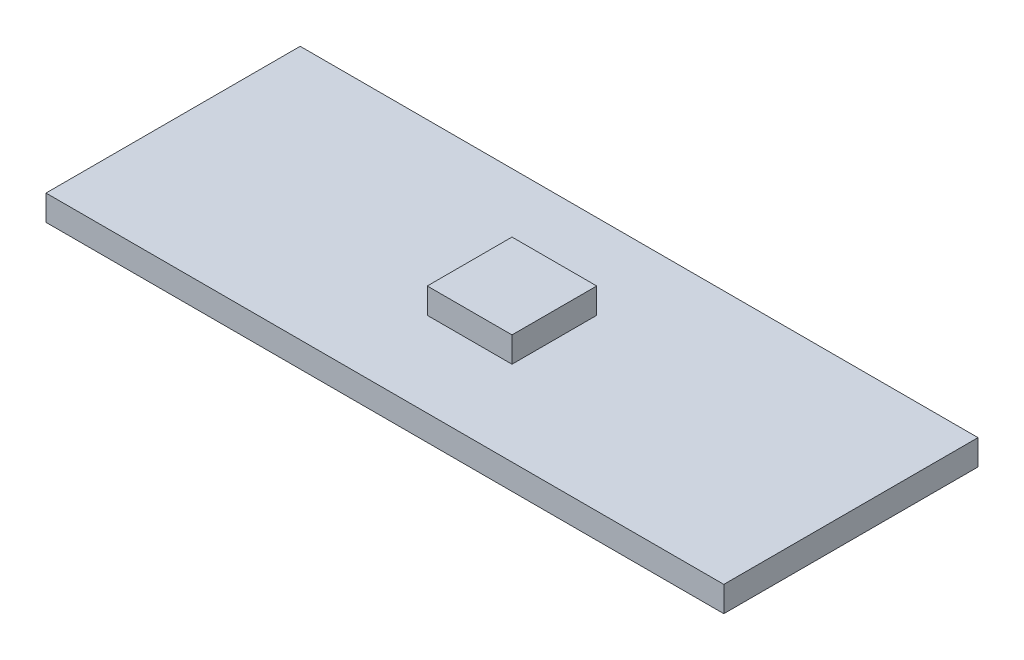
ISO-10303-21;
HEADER;
FILE_DESCRIPTION(('STEP AP214'),'2;1');
FILE_NAME('part.step','',(''),(''),'','','');
FILE_SCHEMA(('AUTOMOTIVE_DESIGN { 1 0 10303 214 1 1 1 1 }'));
ENDSEC;
DATA;
#1=APPLICATION_CONTEXT('core data for automotive mechanical design processes');
#2=APPLICATION_PROTOCOL_DEFINITION('international standard','automotive_design',2000,#1);
#3=PRODUCT_CONTEXT('',#1,'mechanical');
#4=PRODUCT('Part','Part','',(#3));
#5=PRODUCT_RELATED_PRODUCT_CATEGORY('part','',(#4));
#6=PRODUCT_DEFINITION_FORMATION('','',#4);
#7=PRODUCT_DEFINITION_CONTEXT('part definition',#1,'design');
#8=PRODUCT_DEFINITION('design','',#6,#7);
#9=PRODUCT_DEFINITION_SHAPE('','',#8);
#10=(LENGTH_UNIT() NAMED_UNIT(*) SI_UNIT(.MILLI.,.METRE.));
#11=(NAMED_UNIT(*) PLANE_ANGLE_UNIT() SI_UNIT($,.RADIAN.));
#12=(NAMED_UNIT(*) SI_UNIT($,.STERADIAN.) SOLID_ANGLE_UNIT());
#13=UNCERTAINTY_MEASURE_WITH_UNIT(LENGTH_MEASURE(1.E-05),#10,'distance_accuracy_value','');
#14=(GEOMETRIC_REPRESENTATION_CONTEXT(3) GLOBAL_UNCERTAINTY_ASSIGNED_CONTEXT((#13)) GLOBAL_UNIT_ASSIGNED_CONTEXT((#10,
#11,#12)) REPRESENTATION_CONTEXT('',''));
#15=CARTESIAN_POINT('',(0.,0.,0.));
#16=DIRECTION('',(0.,0.,1.));
#17=DIRECTION('',(1.,0.,0.));
#18=AXIS2_PLACEMENT_3D('',#15,#16,#17);
#19=CARTESIAN_POINT('',(0.,1.5,0.));
#20=DIRECTION('',(0.,-1.,0.));
#21=DIRECTION('',(0.,0.,-1.));
#22=AXIS2_PLACEMENT_3D('',#19,#20,#21);
#23=PLANE('',#22);
#24=DIRECTION('',(0.,0.,-1.));
#25=VECTOR('',#24,1.);
#26=CARTESIAN_POINT('',(20.,1.5,7.5));
#27=LINE('',#26,#25);
#28=CARTESIAN_POINT('',(20.,1.5,7.5));
#29=VERTEX_POINT('',#28);
#30=CARTESIAN_POINT('',(20.,1.5,-7.5));
#31=VERTEX_POINT('',#30);
#32=EDGE_CURVE('E134',#29,#31,#27,.T.);
#33=ORIENTED_EDGE('',*,*,#32,.T.);
#34=DIRECTION('',(-1.,0.,0.));
#35=VECTOR('',#34,1.);
#36=CARTESIAN_POINT('',(-20.,1.5,-7.5));
#37=LINE('',#36,#35);
#38=CARTESIAN_POINT('',(-20.,1.5,-7.5));
#39=VERTEX_POINT('',#38);
#40=EDGE_CURVE('E137',#31,#39,#37,.T.);
#41=ORIENTED_EDGE('',*,*,#40,.T.);
#42=DIRECTION('',(0.,0.,1.));
#43=VECTOR('',#42,1.);
#44=CARTESIAN_POINT('',(-20.,1.5,7.5));
#45=LINE('',#44,#43);
#46=CARTESIAN_POINT('',(-20.,1.5,7.5));
#47=VERTEX_POINT('',#46);
#48=EDGE_CURVE('E140',#39,#47,#45,.T.);
#49=ORIENTED_EDGE('',*,*,#48,.T.);
#50=DIRECTION('',(1.,0.,0.));
#51=VECTOR('',#50,1.);
#52=CARTESIAN_POINT('',(-20.,1.5,7.5));
#53=LINE('',#52,#51);
#54=EDGE_CURVE('E142',#47,#29,#53,.T.);
#55=ORIENTED_EDGE('',*,*,#54,.T.);
#56=EDGE_LOOP('',(#33,#41,#49,#55));
#57=FACE_BOUND('',#56,.T.);
#58=DIRECTION('',(0.,0.,-1.));
#59=VECTOR('',#58,1.);
#60=CARTESIAN_POINT('',(2.5,1.5,-2.5));
#61=LINE('',#60,#59);
#62=CARTESIAN_POINT('',(2.5,1.5,2.5));
#63=VERTEX_POINT('',#62);
#64=CARTESIAN_POINT('',(2.5,1.5,-2.5));
#65=VERTEX_POINT('',#64);
#66=EDGE_CURVE('E124',#63,#65,#61,.T.);
#67=ORIENTED_EDGE('',*,*,#66,.F.);
#68=DIRECTION('',(1.,0.,0.));
#69=VECTOR('',#68,1.);
#70=CARTESIAN_POINT('',(-2.5,1.5,2.5));
#71=LINE('',#70,#69);
#72=CARTESIAN_POINT('',(-2.5,1.5,2.5));
#73=VERTEX_POINT('',#72);
#74=EDGE_CURVE('E121',#73,#63,#71,.T.);
#75=ORIENTED_EDGE('',*,*,#74,.F.);
#76=DIRECTION('',(0.,0.,1.));
#77=VECTOR('',#76,1.);
#78=CARTESIAN_POINT('',(-2.5,1.5,-2.5));
#79=LINE('',#78,#77);
#80=CARTESIAN_POINT('',(-2.5,1.5,-2.5));
#81=VERTEX_POINT('',#80);
#82=EDGE_CURVE('E59',#81,#73,#79,.T.);
#83=ORIENTED_EDGE('',*,*,#82,.F.);
#84=DIRECTION('',(-1.,0.,0.));
#85=VECTOR('',#84,1.);
#86=CARTESIAN_POINT('',(-2.5,1.5,-2.5));
#87=LINE('',#86,#85);
#88=EDGE_CURVE('E54',#65,#81,#87,.T.);
#89=ORIENTED_EDGE('',*,*,#88,.F.);
#90=EDGE_LOOP('',(#67,#75,#83,#89));
#91=FACE_BOUND('',#90,.T.);
#92=ADVANCED_FACE('F39',(#57,#91),#23,.F.);
#93=CARTESIAN_POINT('',(20.,1.5,7.5));
#94=DIRECTION('',(-1.,0.,0.));
#95=DIRECTION('',(0.,0.,1.));
#96=AXIS2_PLACEMENT_3D('',#93,#94,#95);
#97=PLANE('',#96);
#98=DIRECTION('',(0.,0.,-1.));
#99=VECTOR('',#98,1.);
#100=CARTESIAN_POINT('',(20.,0.,7.5));
#101=LINE('',#100,#99);
#102=CARTESIAN_POINT('',(20.,0.,7.5));
#103=VERTEX_POINT('',#102);
#104=CARTESIAN_POINT('',(20.,0.,-7.5));
#105=VERTEX_POINT('',#104);
#106=EDGE_CURVE('E125',#103,#105,#101,.T.);
#107=ORIENTED_EDGE('',*,*,#106,.T.);
#108=DIRECTION('',(0.,-1.,0.));
#109=VECTOR('',#108,1.);
#110=CARTESIAN_POINT('',(20.,1.5,-7.5));
#111=LINE('',#110,#109);
#112=EDGE_CURVE('E11',#31,#105,#111,.T.);
#113=ORIENTED_EDGE('',*,*,#112,.F.);
#114=ORIENTED_EDGE('',*,*,#32,.F.);
#115=DIRECTION('',(0.,-1.,0.));
#116=VECTOR('',#115,1.);
#117=CARTESIAN_POINT('',(20.,1.5,7.5));
#118=LINE('',#117,#116);
#119=EDGE_CURVE('E143',#29,#103,#118,.T.);
#120=ORIENTED_EDGE('',*,*,#119,.T.);
#121=EDGE_LOOP('',(#107,#113,#114,#120));
#122=FACE_BOUND('',#121,.T.);
#123=ADVANCED_FACE('F41',(#122),#97,.F.);
#124=CARTESIAN_POINT('',(-20.,1.5,-7.5));
#125=DIRECTION('',(0.,0.,1.));
#126=DIRECTION('',(1.,0.,0.));
#127=AXIS2_PLACEMENT_3D('',#124,#125,#126);
#128=PLANE('',#127);
#129=DIRECTION('',(-1.,0.,0.));
#130=VECTOR('',#129,1.);
#131=CARTESIAN_POINT('',(-20.,0.,-7.5));
#132=LINE('',#131,#130);
#133=CARTESIAN_POINT('',(-20.,0.,-7.5));
#134=VERTEX_POINT('',#133);
#135=EDGE_CURVE('E128',#105,#134,#132,.T.);
#136=ORIENTED_EDGE('',*,*,#135,.T.);
#137=DIRECTION('',(0.,-1.,0.));
#138=VECTOR('',#137,1.);
#139=CARTESIAN_POINT('',(-20.,1.5,-7.5));
#140=LINE('',#139,#138);
#141=EDGE_CURVE('E47',#39,#134,#140,.T.);
#142=ORIENTED_EDGE('',*,*,#141,.F.);
#143=ORIENTED_EDGE('',*,*,#40,.F.);
#144=ORIENTED_EDGE('',*,*,#112,.T.);
#145=EDGE_LOOP('',(#136,#142,#143,#144));
#146=FACE_BOUND('',#145,.T.);
#147=ADVANCED_FACE('F173',(#146),#128,.F.);
#148=CARTESIAN_POINT('',(-20.,1.5,7.5));
#149=DIRECTION('',(1.,0.,0.));
#150=DIRECTION('',(0.,0.,-1.));
#151=AXIS2_PLACEMENT_3D('',#148,#149,#150);
#152=PLANE('',#151);
#153=DIRECTION('',(0.,0.,1.));
#154=VECTOR('',#153,1.);
#155=CARTESIAN_POINT('',(-20.,0.,7.5));
#156=LINE('',#155,#154);
#157=CARTESIAN_POINT('',(-20.,0.,7.5));
#158=VERTEX_POINT('',#157);
#159=EDGE_CURVE('E146',#134,#158,#156,.T.);
#160=ORIENTED_EDGE('',*,*,#159,.T.);
#161=DIRECTION('',(0.,-1.,0.));
#162=VECTOR('',#161,1.);
#163=CARTESIAN_POINT('',(-20.,1.5,7.5));
#164=LINE('',#163,#162);
#165=EDGE_CURVE('E151',#47,#158,#164,.T.);
#166=ORIENTED_EDGE('',*,*,#165,.F.);
#167=ORIENTED_EDGE('',*,*,#48,.F.);
#168=ORIENTED_EDGE('',*,*,#141,.T.);
#169=EDGE_LOOP('',(#160,#166,#167,#168));
#170=FACE_BOUND('',#169,.T.);
#171=ADVANCED_FACE('F158',(#170),#152,.F.);
#172=CARTESIAN_POINT('',(-20.,1.5,7.5));
#173=DIRECTION('',(0.,0.,-1.));
#174=DIRECTION('',(-1.,0.,0.));
#175=AXIS2_PLACEMENT_3D('',#172,#173,#174);
#176=PLANE('',#175);
#177=DIRECTION('',(1.,0.,0.));
#178=VECTOR('',#177,1.);
#179=CARTESIAN_POINT('',(-20.,0.,7.5));
#180=LINE('',#179,#178);
#181=EDGE_CURVE('E138',#158,#103,#180,.T.);
#182=ORIENTED_EDGE('',*,*,#181,.T.);
#183=ORIENTED_EDGE('',*,*,#119,.F.);
#184=ORIENTED_EDGE('',*,*,#54,.F.);
#185=ORIENTED_EDGE('',*,*,#165,.T.);
#186=EDGE_LOOP('',(#182,#183,#184,#185));
#187=FACE_BOUND('',#186,.T.);
#188=ADVANCED_FACE('F167',(#187),#176,.F.);
#189=CARTESIAN_POINT('',(0.,0.,0.));
#190=DIRECTION('',(0.,-1.,0.));
#191=DIRECTION('',(0.,0.,-1.));
#192=AXIS2_PLACEMENT_3D('',#189,#190,#191);
#193=PLANE('',#192);
#194=ORIENTED_EDGE('',*,*,#106,.F.);
#195=ORIENTED_EDGE('',*,*,#181,.F.);
#196=ORIENTED_EDGE('',*,*,#159,.F.);
#197=ORIENTED_EDGE('',*,*,#135,.F.);
#198=EDGE_LOOP('',(#194,#195,#196,#197));
#199=FACE_BOUND('',#198,.T.);
#200=ADVANCED_FACE('F164',(#199),#193,.T.);
#201=CARTESIAN_POINT('',(2.5,3.,-2.5));
#202=DIRECTION('',(-1.,0.,0.));
#203=DIRECTION('',(0.,0.,1.));
#204=AXIS2_PLACEMENT_3D('',#201,#202,#203);
#205=PLANE('',#204);
#206=ORIENTED_EDGE('',*,*,#66,.T.);
#207=DIRECTION('',(0.,-1.,0.));
#208=VECTOR('',#207,1.);
#209=CARTESIAN_POINT('',(2.5,3.,-2.5));
#210=LINE('',#209,#208);
#211=CARTESIAN_POINT('',(2.5,3.,-2.5));
#212=VERTEX_POINT('',#211);
#213=EDGE_CURVE('E105',#212,#65,#210,.T.);
#214=ORIENTED_EDGE('',*,*,#213,.F.);
#215=DIRECTION('',(0.,0.,-1.));
#216=VECTOR('',#215,1.);
#217=CARTESIAN_POINT('',(2.5,3.,-2.5));
#218=LINE('',#217,#216);
#219=CARTESIAN_POINT('',(2.5,3.,2.5));
#220=VERTEX_POINT('',#219);
#221=EDGE_CURVE('E112',#220,#212,#218,.T.);
#222=ORIENTED_EDGE('',*,*,#221,.F.);
#223=DIRECTION('',(0.,-1.,0.));
#224=VECTOR('',#223,1.);
#225=CARTESIAN_POINT('',(2.5,3.,2.5));
#226=LINE('',#225,#224);
#227=EDGE_CURVE('E288',#220,#63,#226,.T.);
#228=ORIENTED_EDGE('',*,*,#227,.T.);
#229=EDGE_LOOP('',(#206,#214,#222,#228));
#230=FACE_BOUND('',#229,.T.);
#231=ADVANCED_FACE('F123',(#230),#205,.F.);
#232=CARTESIAN_POINT('',(-2.5,3.,-2.5));
#233=DIRECTION('',(0.,0.,1.));
#234=DIRECTION('',(1.,0.,0.));
#235=AXIS2_PLACEMENT_3D('',#232,#233,#234);
#236=PLANE('',#235);
#237=ORIENTED_EDGE('',*,*,#88,.T.);
#238=DIRECTION('',(0.,-1.,0.));
#239=VECTOR('',#238,1.);
#240=CARTESIAN_POINT('',(-2.5,3.,-2.5));
#241=LINE('',#240,#239);
#242=CARTESIAN_POINT('',(-2.5,3.,-2.5));
#243=VERTEX_POINT('',#242);
#244=EDGE_CURVE('E108',#243,#81,#241,.T.);
#245=ORIENTED_EDGE('',*,*,#244,.F.);
#246=DIRECTION('',(-1.,0.,0.));
#247=VECTOR('',#246,1.);
#248=CARTESIAN_POINT('',(-2.5,3.,-2.5));
#249=LINE('',#248,#247);
#250=EDGE_CURVE('E101',#212,#243,#249,.T.);
#251=ORIENTED_EDGE('',*,*,#250,.F.);
#252=ORIENTED_EDGE('',*,*,#213,.T.);
#253=EDGE_LOOP('',(#237,#245,#251,#252));
#254=FACE_BOUND('',#253,.T.);
#255=ADVANCED_FACE('F103',(#254),#236,.F.);
#256=CARTESIAN_POINT('',(-2.5,3.,-2.5));
#257=DIRECTION('',(1.,0.,0.));
#258=DIRECTION('',(0.,0.,-1.));
#259=AXIS2_PLACEMENT_3D('',#256,#257,#258);
#260=PLANE('',#259);
#261=ORIENTED_EDGE('',*,*,#82,.T.);
#262=DIRECTION('',(0.,-1.,0.));
#263=VECTOR('',#262,1.);
#264=CARTESIAN_POINT('',(-2.5,3.,2.5));
#265=LINE('',#264,#263);
#266=CARTESIAN_POINT('',(-2.5,3.,2.5));
#267=VERTEX_POINT('',#266);
#268=EDGE_CURVE('E130',#267,#73,#265,.T.);
#269=ORIENTED_EDGE('',*,*,#268,.F.);
#270=DIRECTION('',(0.,0.,1.));
#271=VECTOR('',#270,1.);
#272=CARTESIAN_POINT('',(-2.5,3.,-2.5));
#273=LINE('',#272,#271);
#274=EDGE_CURVE('E111',#243,#267,#273,.T.);
#275=ORIENTED_EDGE('',*,*,#274,.F.);
#276=ORIENTED_EDGE('',*,*,#244,.T.);
#277=EDGE_LOOP('',(#261,#269,#275,#276));
#278=FACE_BOUND('',#277,.T.);
#279=ADVANCED_FACE('F209',(#278),#260,.F.);
#280=CARTESIAN_POINT('',(-2.5,3.,2.5));
#281=DIRECTION('',(0.,0.,-1.));
#282=DIRECTION('',(-1.,0.,0.));
#283=AXIS2_PLACEMENT_3D('',#280,#281,#282);
#284=PLANE('',#283);
#285=ORIENTED_EDGE('',*,*,#74,.T.);
#286=ORIENTED_EDGE('',*,*,#227,.F.);
#287=DIRECTION('',(1.,0.,0.));
#288=VECTOR('',#287,1.);
#289=CARTESIAN_POINT('',(-2.5,3.,2.5));
#290=LINE('',#289,#288);
#291=EDGE_CURVE('E117',#267,#220,#290,.T.);
#292=ORIENTED_EDGE('',*,*,#291,.F.);
#293=ORIENTED_EDGE('',*,*,#268,.T.);
#294=EDGE_LOOP('',(#285,#286,#292,#293));
#295=FACE_BOUND('',#294,.T.);
#296=ADVANCED_FACE('F215',(#295),#284,.F.);
#297=CARTESIAN_POINT('',(0.,3.,0.));
#298=DIRECTION('',(0.,1.,0.));
#299=DIRECTION('',(0.,0.,1.));
#300=AXIS2_PLACEMENT_3D('',#297,#298,#299);
#301=PLANE('',#300);
#302=ORIENTED_EDGE('',*,*,#221,.T.);
#303=ORIENTED_EDGE('',*,*,#250,.T.);
#304=ORIENTED_EDGE('',*,*,#274,.T.);
#305=ORIENTED_EDGE('',*,*,#291,.T.);
#306=EDGE_LOOP('',(#302,#303,#304,#305));
#307=FACE_BOUND('',#306,.T.);
#308=ADVANCED_FACE('F115',(#307),#301,.T.);
#309=CLOSED_SHELL('',(#92,#123,#147,#171,#188,#200,#231,#255,#279,#296,#308));
#310=MANIFOLD_SOLID_BREP('B2',#309);
#311=ADVANCED_BREP_SHAPE_REPRESENTATION('',(#18,#310),#14);
#312=SHAPE_DEFINITION_REPRESENTATION(#9,#311);
ENDSEC;
END-ISO-10303-21;
